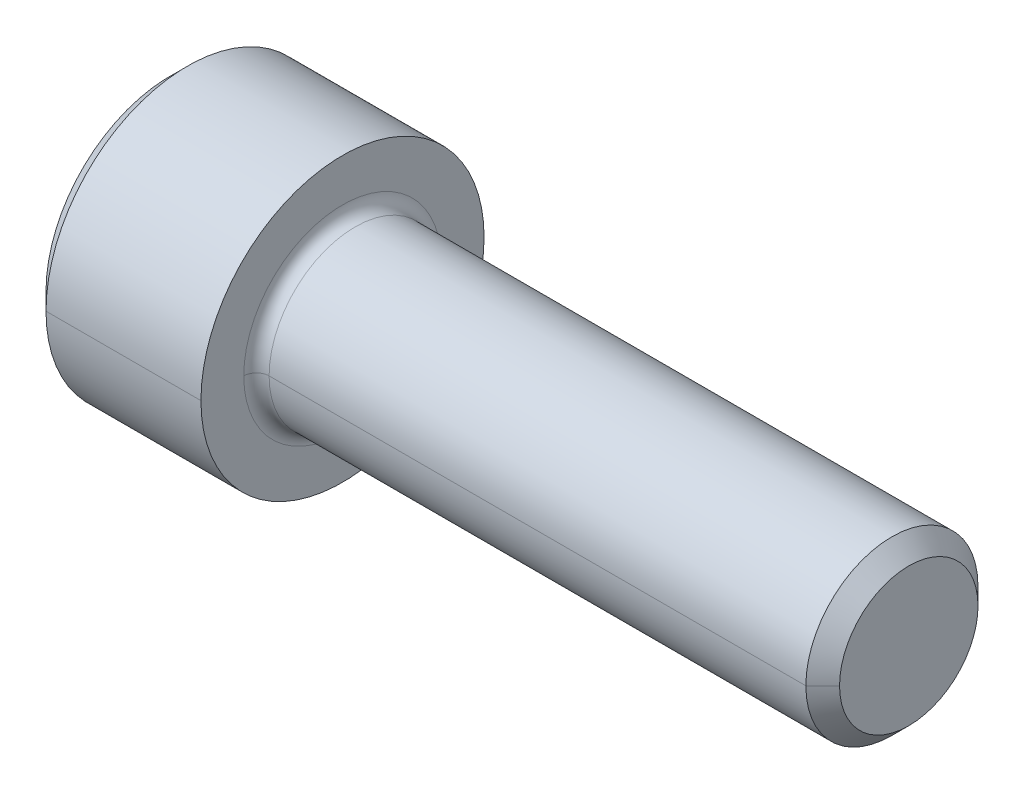
ISO-10303-21;
HEADER;
FILE_DESCRIPTION(('STEP AP214'),'2;1');
FILE_NAME('part.step','',(''),(''),'','','');
FILE_SCHEMA(('AUTOMOTIVE_DESIGN { 1 0 10303 214 1 1 1 1 }'));
ENDSEC;
DATA;
#1=APPLICATION_CONTEXT('core data for automotive mechanical design processes');
#2=APPLICATION_PROTOCOL_DEFINITION('international standard','automotive_design',2000,#1);
#3=PRODUCT_CONTEXT('',#1,'mechanical');
#4=PRODUCT('Part','Part','',(#3));
#5=PRODUCT_RELATED_PRODUCT_CATEGORY('part','',(#4));
#6=PRODUCT_DEFINITION_FORMATION('','',#4);
#7=PRODUCT_DEFINITION_CONTEXT('part definition',#1,'design');
#8=PRODUCT_DEFINITION('design','',#6,#7);
#9=PRODUCT_DEFINITION_SHAPE('','',#8);
#10=(LENGTH_UNIT() NAMED_UNIT(*) SI_UNIT(.MILLI.,.METRE.));
#11=(NAMED_UNIT(*) PLANE_ANGLE_UNIT() SI_UNIT($,.RADIAN.));
#12=(NAMED_UNIT(*) SI_UNIT($,.STERADIAN.) SOLID_ANGLE_UNIT());
#13=UNCERTAINTY_MEASURE_WITH_UNIT(LENGTH_MEASURE(1.E-05),#10,'distance_accuracy_value','');
#14=(GEOMETRIC_REPRESENTATION_CONTEXT(3) GLOBAL_UNCERTAINTY_ASSIGNED_CONTEXT((#13)) GLOBAL_UNIT_ASSIGNED_CONTEXT((#10,
#11,#12)) REPRESENTATION_CONTEXT('',''));
#15=CARTESIAN_POINT('',(0.,0.,0.));
#16=DIRECTION('',(0.,0.,1.));
#17=DIRECTION('',(1.,0.,0.));
#18=AXIS2_PLACEMENT_3D('',#15,#16,#17);
#19=CARTESIAN_POINT('',(2.286,0.,0.));
#20=DIRECTION('',(-1.,0.,0.));
#21=DIRECTION('',(0.,0.,1.));
#22=AXIS2_PLACEMENT_3D('',#19,#20,#21);
#23=CONICAL_SURFACE('',#22,1.98501,1.0471975511966);
#24=DIRECTION('',(-0.5,0.,-0.866025403784437));
#25=VECTOR('',#24,1.);
#26=CARTESIAN_POINT('',(2.286,0.,-1.98501));
#27=LINE('',#26,#25);
#28=CARTESIAN_POINT('',(3.43204605784411,0.,0.));
#29=VERTEX_POINT('',#28);
#30=CARTESIAN_POINT('',(2.286,0.,-1.98501));
#31=VERTEX_POINT('',#30);
#32=EDGE_CURVE('E174',#29,#31,#27,.T.);
#33=ORIENTED_EDGE('',*,*,#32,.F.);
#34=DIRECTION('',(-0.5,0.,0.866025403784437));
#35=VECTOR('',#34,1.);
#36=CARTESIAN_POINT('',(2.286,0.,1.98501));
#37=LINE('',#36,#35);
#38=CARTESIAN_POINT('',(2.286,0.,1.98501));
#39=VERTEX_POINT('',#38);
#40=EDGE_CURVE('E176',#29,#39,#37,.T.);
#41=ORIENTED_EDGE('',*,*,#40,.T.);
#42=CARTESIAN_POINT('',(2.286,0.,0.));
#43=DIRECTION('',(-1.,0.,0.));
#44=DIRECTION('',(0.,0.,1.));
#45=AXIS2_PLACEMENT_3D('',#42,#43,#44);
#46=CIRCLE('',#45,1.98501);
#47=CARTESIAN_POINT('',(2.286,1.71906908676615,0.992505));
#48=VERTEX_POINT('',#47);
#49=EDGE_CURVE('E11',#39,#48,#46,.T.);
#50=ORIENTED_EDGE('',*,*,#49,.T.);
#51=CARTESIAN_POINT('',(2.286,0.,0.));
#52=DIRECTION('',(-1.,0.,0.));
#53=DIRECTION('',(0.,0.,1.));
#54=AXIS2_PLACEMENT_3D('',#51,#52,#53);
#55=CIRCLE('',#54,1.98501);
#56=CARTESIAN_POINT('',(2.286,1.71906908676615,-0.992505));
#57=VERTEX_POINT('',#56);
#58=EDGE_CURVE('E20',#48,#57,#55,.T.);
#59=ORIENTED_EDGE('',*,*,#58,.T.);
#60=CARTESIAN_POINT('',(2.286,0.,0.));
#61=DIRECTION('',(-1.,0.,0.));
#62=DIRECTION('',(0.,0.,1.));
#63=AXIS2_PLACEMENT_3D('',#60,#61,#62);
#64=CIRCLE('',#63,1.98501);
#65=EDGE_CURVE('E177',#57,#31,#64,.T.);
#66=ORIENTED_EDGE('',*,*,#65,.T.);
#67=EDGE_LOOP('',(#33,#41,#50,#59,#66));
#68=FACE_BOUND('',#67,.T.);
#69=ADVANCED_FACE('F17',(#68),#23,.F.);
#70=CARTESIAN_POINT('',(2.286,1.14604605784411,1.98501));
#71=DIRECTION('',(-1.,0.,0.));
#72=DIRECTION('',(0.,0.,1.));
#73=AXIS2_PLACEMENT_3D('',#70,#71,#72);
#74=PLANE('',#73);
#75=ORIENTED_EDGE('',*,*,#49,.F.);
#76=DIRECTION('',(0.,1.,0.));
#77=VECTOR('',#76,1.);
#78=CARTESIAN_POINT('',(2.286,-1.14604605784409,1.98501));
#79=LINE('',#78,#77);
#80=CARTESIAN_POINT('',(2.286,1.14604605784411,1.98501));
#81=VERTEX_POINT('',#80);
#82=EDGE_CURVE('E206',#39,#81,#79,.T.);
#83=ORIENTED_EDGE('',*,*,#82,.T.);
#84=DIRECTION('',(0.,-0.5,0.86602540378444));
#85=VECTOR('',#84,1.);
#86=CARTESIAN_POINT('',(2.286,2.29209211568821,0.));
#87=LINE('',#86,#85);
#88=EDGE_CURVE('E207',#48,#81,#87,.T.);
#89=ORIENTED_EDGE('',*,*,#88,.F.);
#90=EDGE_LOOP('',(#75,#83,#89));
#91=FACE_BOUND('',#90,.T.);
#92=ADVANCED_FACE('F781',(#91),#74,.T.);
#93=CARTESIAN_POINT('',(2.286,1.14604605784411,1.98501));
#94=DIRECTION('',(-1.,0.,0.));
#95=DIRECTION('',(0.,0.,1.));
#96=AXIS2_PLACEMENT_3D('',#93,#94,#95);
#97=PLANE('',#96);
#98=ORIENTED_EDGE('',*,*,#58,.F.);
#99=DIRECTION('',(0.,-0.5,0.86602540378444));
#100=VECTOR('',#99,1.);
#101=CARTESIAN_POINT('',(2.286,2.29209211568821,0.));
#102=LINE('',#101,#100);
#103=CARTESIAN_POINT('',(2.286,2.29209211568821,0.));
#104=VERTEX_POINT('',#103);
#105=EDGE_CURVE('E233',#104,#48,#102,.T.);
#106=ORIENTED_EDGE('',*,*,#105,.F.);
#107=DIRECTION('',(0.,-0.5,-0.866025403784438));
#108=VECTOR('',#107,1.);
#109=CARTESIAN_POINT('',(2.286,2.29209211568821,0.));
#110=LINE('',#109,#108);
#111=EDGE_CURVE('E296',#104,#57,#110,.T.);
#112=ORIENTED_EDGE('',*,*,#111,.T.);
#113=EDGE_LOOP('',(#98,#106,#112));
#114=FACE_BOUND('',#113,.T.);
#115=ADVANCED_FACE('F679',(#114),#97,.T.);
#116=CARTESIAN_POINT('',(2.286,1.14604605784411,1.98501));
#117=DIRECTION('',(-1.,0.,0.));
#118=DIRECTION('',(0.,0.,1.));
#119=AXIS2_PLACEMENT_3D('',#116,#117,#118);
#120=PLANE('',#119);
#121=ORIENTED_EDGE('',*,*,#65,.F.);
#122=DIRECTION('',(0.,-0.5,-0.866025403784438));
#123=VECTOR('',#122,1.);
#124=CARTESIAN_POINT('',(2.286,2.29209211568821,0.));
#125=LINE('',#124,#123);
#126=CARTESIAN_POINT('',(2.286,1.1460460578441,-1.98501));
#127=VERTEX_POINT('',#126);
#128=EDGE_CURVE('E47',#57,#127,#125,.T.);
#129=ORIENTED_EDGE('',*,*,#128,.T.);
#130=DIRECTION('',(0.,-1.,0.));
#131=VECTOR('',#130,1.);
#132=CARTESIAN_POINT('',(2.286,1.1460460578441,-1.98501));
#133=LINE('',#132,#131);
#134=EDGE_CURVE('E352',#127,#31,#133,.T.);
#135=ORIENTED_EDGE('',*,*,#134,.T.);
#136=EDGE_LOOP('',(#121,#129,#135));
#137=FACE_BOUND('',#136,.T.);
#138=ADVANCED_FACE('F674',(#137),#120,.T.);
#139=CARTESIAN_POINT('',(2.286,1.14604605784411,1.98501));
#140=DIRECTION('',(-1.,0.,0.));
#141=DIRECTION('',(0.,0.,1.));
#142=AXIS2_PLACEMENT_3D('',#139,#140,#141);
#143=PLANE('',#142);
#144=CARTESIAN_POINT('',(2.286,0.,0.));
#145=DIRECTION('',(-1.,0.,0.));
#146=DIRECTION('',(0.,0.,1.));
#147=AXIS2_PLACEMENT_3D('',#144,#145,#146);
#148=CIRCLE('',#147,1.98501);
#149=CARTESIAN_POINT('',(2.286,-1.71906908676615,-0.992505));
#150=VERTEX_POINT('',#149);
#151=EDGE_CURVE('E181',#31,#150,#148,.T.);
#152=ORIENTED_EDGE('',*,*,#151,.F.);
#153=DIRECTION('',(0.,-1.,0.));
#154=VECTOR('',#153,1.);
#155=CARTESIAN_POINT('',(2.286,1.1460460578441,-1.98501));
#156=LINE('',#155,#154);
#157=CARTESIAN_POINT('',(2.286,-1.1460460578441,-1.98501));
#158=VERTEX_POINT('',#157);
#159=EDGE_CURVE('E213',#31,#158,#156,.T.);
#160=ORIENTED_EDGE('',*,*,#159,.T.);
#161=DIRECTION('',(0.,0.5,-0.86602540378444));
#162=VECTOR('',#161,1.);
#163=CARTESIAN_POINT('',(2.286,-2.2920921156882,0.));
#164=LINE('',#163,#162);
#165=EDGE_CURVE('E214',#150,#158,#164,.T.);
#166=ORIENTED_EDGE('',*,*,#165,.F.);
#167=EDGE_LOOP('',(#152,#160,#166));
#168=FACE_BOUND('',#167,.T.);
#169=ADVANCED_FACE('F678',(#168),#143,.T.);
#170=CARTESIAN_POINT('',(2.286,1.14604605784411,1.98501));
#171=DIRECTION('',(-1.,0.,0.));
#172=DIRECTION('',(0.,0.,1.));
#173=AXIS2_PLACEMENT_3D('',#170,#171,#172);
#174=PLANE('',#173);
#175=CARTESIAN_POINT('',(2.286,0.,0.));
#176=DIRECTION('',(-1.,0.,0.));
#177=DIRECTION('',(0.,0.,1.));
#178=AXIS2_PLACEMENT_3D('',#175,#176,#177);
#179=CIRCLE('',#178,1.98501);
#180=CARTESIAN_POINT('',(2.286,-1.71906908676614,0.992505));
#181=VERTEX_POINT('',#180);
#182=EDGE_CURVE('E202',#150,#181,#179,.T.);
#183=ORIENTED_EDGE('',*,*,#182,.F.);
#184=DIRECTION('',(0.,0.5,-0.86602540378444));
#185=VECTOR('',#184,1.);
#186=CARTESIAN_POINT('',(2.286,-2.2920921156882,0.));
#187=LINE('',#186,#185);
#188=CARTESIAN_POINT('',(2.286,-2.2920921156882,0.));
#189=VERTEX_POINT('',#188);
#190=EDGE_CURVE('E269',#189,#150,#187,.T.);
#191=ORIENTED_EDGE('',*,*,#190,.F.);
#192=DIRECTION('',(0.,-0.5,-0.866025403784438));
#193=VECTOR('',#192,1.);
#194=CARTESIAN_POINT('',(2.286,-1.14604605784409,1.98501));
#195=LINE('',#194,#193);
#196=EDGE_CURVE('E351',#181,#189,#195,.T.);
#197=ORIENTED_EDGE('',*,*,#196,.F.);
#198=EDGE_LOOP('',(#183,#191,#197));
#199=FACE_BOUND('',#198,.T.);
#200=ADVANCED_FACE('F865',(#199),#174,.T.);
#201=CARTESIAN_POINT('',(2.286,1.14604605784411,1.98501));
#202=DIRECTION('',(-1.,0.,0.));
#203=DIRECTION('',(0.,0.,1.));
#204=AXIS2_PLACEMENT_3D('',#201,#202,#203);
#205=PLANE('',#204);
#206=CARTESIAN_POINT('',(2.286,0.,0.));
#207=DIRECTION('',(-1.,0.,0.));
#208=DIRECTION('',(0.,0.,1.));
#209=AXIS2_PLACEMENT_3D('',#206,#207,#208);
#210=CIRCLE('',#209,1.98501);
#211=EDGE_CURVE('E187',#181,#39,#210,.T.);
#212=ORIENTED_EDGE('',*,*,#211,.F.);
#213=DIRECTION('',(0.,-0.5,-0.866025403784438));
#214=VECTOR('',#213,1.);
#215=CARTESIAN_POINT('',(2.286,-1.14604605784409,1.98501));
#216=LINE('',#215,#214);
#217=CARTESIAN_POINT('',(2.286,-1.14604605784409,1.98501));
#218=VERTEX_POINT('',#217);
#219=EDGE_CURVE('E347',#218,#181,#216,.T.);
#220=ORIENTED_EDGE('',*,*,#219,.F.);
#221=DIRECTION('',(0.,1.,0.));
#222=VECTOR('',#221,1.);
#223=CARTESIAN_POINT('',(2.286,-1.14604605784409,1.98501));
#224=LINE('',#223,#222);
#225=EDGE_CURVE('E336',#218,#39,#224,.T.);
#226=ORIENTED_EDGE('',*,*,#225,.T.);
#227=EDGE_LOOP('',(#212,#220,#226));
#228=FACE_BOUND('',#227,.T.);
#229=ADVANCED_FACE('F856',(#228),#205,.T.);
#230=CARTESIAN_POINT('',(2.286,2.29209211568821,0.));
#231=DIRECTION('',(0.,0.866025403784438,-0.5));
#232=DIRECTION('',(-1.,0.,0.));
#233=AXIS2_PLACEMENT_3D('',#230,#231,#232);
#234=PLANE('',#233);
#235=DIRECTION('',(0.,-0.5,-0.866025403784438));
#236=VECTOR('',#235,1.);
#237=CARTESIAN_POINT('',(0.,2.29209211568821,0.));
#238=LINE('',#237,#236);
#239=CARTESIAN_POINT('',(0.,2.29209211568821,0.));
#240=VERTEX_POINT('',#239);
#241=CARTESIAN_POINT('',(0.,1.1460460578441,-1.98501));
#242=VERTEX_POINT('',#241);
#243=EDGE_CURVE('E314',#240,#242,#238,.T.);
#244=ORIENTED_EDGE('',*,*,#243,.T.);
#245=DIRECTION('',(-1.,0.,0.));
#246=VECTOR('',#245,1.);
#247=CARTESIAN_POINT('',(2.286,1.1460460578441,-1.98501));
#248=LINE('',#247,#246);
#249=EDGE_CURVE('E355',#127,#242,#248,.T.);
#250=ORIENTED_EDGE('',*,*,#249,.F.);
#251=ORIENTED_EDGE('',*,*,#128,.F.);
#252=ORIENTED_EDGE('',*,*,#111,.F.);
#253=DIRECTION('',(-1.,0.,0.));
#254=VECTOR('',#253,1.);
#255=CARTESIAN_POINT('',(2.286,2.29209211568821,0.));
#256=LINE('',#255,#254);
#257=EDGE_CURVE('E237',#104,#240,#256,.T.);
#258=ORIENTED_EDGE('',*,*,#257,.T.);
#259=EDGE_LOOP('',(#244,#250,#251,#252,#258));
#260=FACE_BOUND('',#259,.T.);
#261=ADVANCED_FACE('F847',(#260),#234,.F.);
#262=CARTESIAN_POINT('',(2.286,1.1460460578441,-1.98501));
#263=DIRECTION('',(0.,0.,-1.));
#264=DIRECTION('',(0.,-1.,0.));
#265=AXIS2_PLACEMENT_3D('',#262,#263,#264);
#266=PLANE('',#265);
#267=DIRECTION('',(0.,-1.,0.));
#268=VECTOR('',#267,1.);
#269=CARTESIAN_POINT('',(0.,1.1460460578441,-1.98501));
#270=LINE('',#269,#268);
#271=CARTESIAN_POINT('',(0.,-1.1460460578441,-1.98501));
#272=VERTEX_POINT('',#271);
#273=EDGE_CURVE('E310',#242,#272,#270,.T.);
#274=ORIENTED_EDGE('',*,*,#273,.T.);
#275=DIRECTION('',(-1.,0.,0.));
#276=VECTOR('',#275,1.);
#277=CARTESIAN_POINT('',(2.286,-1.1460460578441,-1.98501));
#278=LINE('',#277,#276);
#279=EDGE_CURVE('E210',#158,#272,#278,.T.);
#280=ORIENTED_EDGE('',*,*,#279,.F.);
#281=ORIENTED_EDGE('',*,*,#159,.F.);
#282=ORIENTED_EDGE('',*,*,#134,.F.);
#283=ORIENTED_EDGE('',*,*,#249,.T.);
#284=EDGE_LOOP('',(#274,#280,#281,#282,#283));
#285=FACE_BOUND('',#284,.T.);
#286=ADVANCED_FACE('F838',(#285),#266,.F.);
#287=CARTESIAN_POINT('',(2.286,-2.2920921156882,0.));
#288=DIRECTION('',(0.,0.866025403784439,0.5));
#289=DIRECTION('',(1.,0.,0.));
#290=AXIS2_PLACEMENT_3D('',#287,#288,#289);
#291=PLANE('',#290);
#292=DIRECTION('',(0.,0.5,-0.86602540378444));
#293=VECTOR('',#292,1.);
#294=CARTESIAN_POINT('',(0.,-2.2920921156882,0.));
#295=LINE('',#294,#293);
#296=CARTESIAN_POINT('',(0.,-2.2920921156882,0.));
#297=VERTEX_POINT('',#296);
#298=EDGE_CURVE('E306',#297,#272,#295,.T.);
#299=ORIENTED_EDGE('',*,*,#298,.F.);
#300=DIRECTION('',(-1.,0.,0.));
#301=VECTOR('',#300,1.);
#302=CARTESIAN_POINT('',(2.286,-2.2920921156882,0.));
#303=LINE('',#302,#301);
#304=EDGE_CURVE('E359',#189,#297,#303,.T.);
#305=ORIENTED_EDGE('',*,*,#304,.F.);
#306=ORIENTED_EDGE('',*,*,#190,.T.);
#307=ORIENTED_EDGE('',*,*,#165,.T.);
#308=ORIENTED_EDGE('',*,*,#279,.T.);
#309=EDGE_LOOP('',(#299,#305,#306,#307,#308));
#310=FACE_BOUND('',#309,.T.);
#311=ADVANCED_FACE('F829',(#310),#291,.T.);
#312=CARTESIAN_POINT('',(2.286,-1.14604605784409,1.98501));
#313=DIRECTION('',(0.,0.866025403784438,-0.5));
#314=DIRECTION('',(-1.,0.,0.));
#315=AXIS2_PLACEMENT_3D('',#312,#313,#314);
#316=PLANE('',#315);
#317=DIRECTION('',(0.,-0.5,-0.866025403784438));
#318=VECTOR('',#317,1.);
#319=CARTESIAN_POINT('',(0.,-1.14604605784409,1.98501));
#320=LINE('',#319,#318);
#321=CARTESIAN_POINT('',(0.,-1.14604605784409,1.98501));
#322=VERTEX_POINT('',#321);
#323=EDGE_CURVE('E219',#322,#297,#320,.T.);
#324=ORIENTED_EDGE('',*,*,#323,.F.);
#325=DIRECTION('',(-1.,0.,0.));
#326=VECTOR('',#325,1.);
#327=CARTESIAN_POINT('',(2.286,-1.14604605784409,1.98501));
#328=LINE('',#327,#326);
#329=EDGE_CURVE('E344',#218,#322,#328,.T.);
#330=ORIENTED_EDGE('',*,*,#329,.F.);
#331=ORIENTED_EDGE('',*,*,#219,.T.);
#332=ORIENTED_EDGE('',*,*,#196,.T.);
#333=ORIENTED_EDGE('',*,*,#304,.T.);
#334=EDGE_LOOP('',(#324,#330,#331,#332,#333));
#335=FACE_BOUND('',#334,.T.);
#336=ADVANCED_FACE('F720',(#335),#316,.T.);
#337=CARTESIAN_POINT('',(2.286,-1.14604605784409,1.98501));
#338=DIRECTION('',(0.,0.,1.));
#339=DIRECTION('',(0.,-1.,0.));
#340=AXIS2_PLACEMENT_3D('',#337,#338,#339);
#341=PLANE('',#340);
#342=DIRECTION('',(0.,1.,0.));
#343=VECTOR('',#342,1.);
#344=CARTESIAN_POINT('',(0.,-1.14604605784409,1.98501));
#345=LINE('',#344,#343);
#346=CARTESIAN_POINT('',(0.,1.14604605784411,1.98501));
#347=VERTEX_POINT('',#346);
#348=EDGE_CURVE('E215',#322,#347,#345,.T.);
#349=ORIENTED_EDGE('',*,*,#348,.T.);
#350=DIRECTION('',(-1.,0.,0.));
#351=VECTOR('',#350,1.);
#352=CARTESIAN_POINT('',(2.286,1.14604605784411,1.98501));
#353=LINE('',#352,#351);
#354=EDGE_CURVE('E203',#81,#347,#353,.T.);
#355=ORIENTED_EDGE('',*,*,#354,.F.);
#356=ORIENTED_EDGE('',*,*,#82,.F.);
#357=ORIENTED_EDGE('',*,*,#225,.F.);
#358=ORIENTED_EDGE('',*,*,#329,.T.);
#359=EDGE_LOOP('',(#349,#355,#356,#357,#358));
#360=FACE_BOUND('',#359,.T.);
#361=ADVANCED_FACE('F715',(#360),#341,.F.);
#362=CARTESIAN_POINT('',(2.286,2.29209211568821,0.));
#363=DIRECTION('',(0.,-0.86602540378444,-0.5));
#364=DIRECTION('',(0.,0.5,-0.86602540378444));
#365=AXIS2_PLACEMENT_3D('',#362,#363,#364);
#366=PLANE('',#365);
#367=DIRECTION('',(0.,-0.5,0.86602540378444));
#368=VECTOR('',#367,1.);
#369=CARTESIAN_POINT('',(0.,2.29209211568821,0.));
#370=LINE('',#369,#368);
#371=EDGE_CURVE('E220',#240,#347,#370,.T.);
#372=ORIENTED_EDGE('',*,*,#371,.F.);
#373=ORIENTED_EDGE('',*,*,#257,.F.);
#374=ORIENTED_EDGE('',*,*,#105,.T.);
#375=ORIENTED_EDGE('',*,*,#88,.T.);
#376=ORIENTED_EDGE('',*,*,#354,.T.);
#377=EDGE_LOOP('',(#372,#373,#374,#375,#376));
#378=FACE_BOUND('',#377,.T.);
#379=ADVANCED_FACE('F719',(#378),#366,.T.);
#380=CARTESIAN_POINT('',(5.1816,0.,0.));
#381=DIRECTION('',(1.,0.,0.));
#382=DIRECTION('',(0.,0.,-1.));
#383=AXIS2_PLACEMENT_3D('',#380,#381,#382);
#384=TOROIDAL_SURFACE('',#383,2.7686,0.3556);
#385=CARTESIAN_POINT('',(5.1816,0.,2.7686));
#386=DIRECTION('',(0.,1.,0.));
#387=DIRECTION('',(0.,0.,1.));
#388=AXIS2_PLACEMENT_3D('',#385,#386,#387);
#389=CIRCLE('',#388,0.3556);
#390=CARTESIAN_POINT('',(5.1816,0.,2.413));
#391=VERTEX_POINT('',#390);
#392=CARTESIAN_POINT('',(4.826,0.,2.7686));
#393=VERTEX_POINT('',#392);
#394=EDGE_CURVE('E199',#391,#393,#389,.T.);
#395=ORIENTED_EDGE('',*,*,#394,.F.);
#396=CARTESIAN_POINT('',(5.1816,0.,0.));
#397=DIRECTION('',(1.,0.,0.));
#398=DIRECTION('',(0.,0.,-1.));
#399=AXIS2_PLACEMENT_3D('',#396,#397,#398);
#400=CIRCLE('',#399,2.413);
#401=CARTESIAN_POINT('',(5.1816,0.,-2.413));
#402=VERTEX_POINT('',#401);
#403=EDGE_CURVE('E262',#402,#391,#400,.T.);
#404=ORIENTED_EDGE('',*,*,#403,.F.);
#405=CARTESIAN_POINT('',(5.1816,0.,-2.7686));
#406=DIRECTION('',(0.,-1.,0.));
#407=DIRECTION('',(0.,0.,-1.));
#408=AXIS2_PLACEMENT_3D('',#405,#406,#407);
#409=CIRCLE('',#408,0.3556);
#410=CARTESIAN_POINT('',(4.826,0.,-2.7686));
#411=VERTEX_POINT('',#410);
#412=EDGE_CURVE('E241',#402,#411,#409,.T.);
#413=ORIENTED_EDGE('',*,*,#412,.T.);
#414=CARTESIAN_POINT('',(4.826,0.,0.));
#415=DIRECTION('',(-1.,0.,0.));
#416=DIRECTION('',(0.,0.,-1.));
#417=AXIS2_PLACEMENT_3D('',#414,#415,#416);
#418=CIRCLE('',#417,2.7686);
#419=EDGE_CURVE('E324',#393,#411,#418,.T.);
#420=ORIENTED_EDGE('',*,*,#419,.F.);
#421=EDGE_LOOP('',(#395,#404,#413,#420));
#422=FACE_BOUND('',#421,.T.);
#423=ADVANCED_FACE('F742',(#422),#384,.F.);
#424=CARTESIAN_POINT('',(20.701,1.94056,0.));
#425=DIRECTION('',(1.,0.,0.));
#426=DIRECTION('',(0.,1.,0.));
#427=AXIS2_PLACEMENT_3D('',#424,#425,#426);
#428=PLANE('',#427);
#429=CARTESIAN_POINT('',(20.701,0.,0.));
#430=DIRECTION('',(-1.,0.,0.));
#431=DIRECTION('',(0.,0.,1.));
#432=AXIS2_PLACEMENT_3D('',#429,#430,#431);
#433=CIRCLE('',#432,1.94056);
#434=CARTESIAN_POINT('',(20.701,0.,1.94056));
#435=VERTEX_POINT('',#434);
#436=CARTESIAN_POINT('',(20.701,0.,-1.94056));
#437=VERTEX_POINT('',#436);
#438=EDGE_CURVE('E247',#435,#437,#433,.T.);
#439=ORIENTED_EDGE('',*,*,#438,.F.);
#440=CARTESIAN_POINT('',(20.701,0.,0.));
#441=DIRECTION('',(-1.,0.,0.));
#442=DIRECTION('',(0.,0.,1.));
#443=AXIS2_PLACEMENT_3D('',#440,#441,#442);
#444=CIRCLE('',#443,1.94056);
#445=EDGE_CURVE('E333',#437,#435,#444,.T.);
#446=ORIENTED_EDGE('',*,*,#445,.F.);
#447=EDGE_LOOP('',(#439,#446));
#448=FACE_BOUND('',#447,.T.);
#449=ADVANCED_FACE('F689',(#448),#428,.T.);
#450=CARTESIAN_POINT('',(20.701,0.,0.));
#451=DIRECTION('',(-1.,0.,0.));
#452=DIRECTION('',(0.,0.,1.));
#453=AXIS2_PLACEMENT_3D('',#450,#451,#452);
#454=CONICAL_SURFACE('',#453,1.94056,0.785398163397408);
#455=DIRECTION('',(-0.707106781186576,0.,-0.707106781186519));
#456=VECTOR('',#455,1.);
#457=CARTESIAN_POINT('',(20.701,0.,-1.94056));
#458=LINE('',#457,#456);
#459=CARTESIAN_POINT('',(20.22856,0.,-2.41299999999997));
#460=VERTEX_POINT('',#459);
#461=EDGE_CURVE('E242',#437,#460,#458,.T.);
#462=ORIENTED_EDGE('',*,*,#461,.F.);
#463=ORIENTED_EDGE('',*,*,#445,.T.);
#464=DIRECTION('',(-0.707106781186576,0.,0.707106781186519));
#465=VECTOR('',#464,1.);
#466=CARTESIAN_POINT('',(20.701,0.,1.94056));
#467=LINE('',#466,#465);
#468=CARTESIAN_POINT('',(20.22856,0.,2.41299999999997));
#469=VERTEX_POINT('',#468);
#470=EDGE_CURVE('E254',#435,#469,#467,.T.);
#471=ORIENTED_EDGE('',*,*,#470,.T.);
#472=CARTESIAN_POINT('',(20.22856,0.,0.));
#473=DIRECTION('',(-1.,0.,0.));
#474=DIRECTION('',(0.,0.,1.));
#475=AXIS2_PLACEMENT_3D('',#472,#473,#474);
#476=CIRCLE('',#475,2.41299999999997);
#477=EDGE_CURVE('E330',#460,#469,#476,.T.);
#478=ORIENTED_EDGE('',*,*,#477,.F.);
#479=EDGE_LOOP('',(#462,#463,#471,#478));
#480=FACE_BOUND('',#479,.T.);
#481=ADVANCED_FACE('F684',(#480),#454,.T.);
#482=CARTESIAN_POINT('',(-31.75,0.,0.));
#483=DIRECTION('',(-1.,0.,0.));
#484=DIRECTION('',(0.,0.,1.));
#485=AXIS2_PLACEMENT_3D('',#482,#483,#484);
#486=CYLINDRICAL_SURFACE('',#485,2.413);
#487=DIRECTION('',(-1.,0.,0.));
#488=VECTOR('',#487,1.);
#489=CARTESIAN_POINT('',(-31.75,0.,-2.413));
#490=LINE('',#489,#488);
#491=EDGE_CURVE('E258',#460,#402,#490,.T.);
#492=ORIENTED_EDGE('',*,*,#491,.F.);
#493=ORIENTED_EDGE('',*,*,#477,.T.);
#494=DIRECTION('',(-1.,0.,0.));
#495=VECTOR('',#494,1.);
#496=CARTESIAN_POINT('',(-31.75,0.,2.413));
#497=LINE('',#496,#495);
#498=EDGE_CURVE('E228',#469,#391,#497,.T.);
#499=ORIENTED_EDGE('',*,*,#498,.T.);
#500=CARTESIAN_POINT('',(5.1816,0.,0.));
#501=DIRECTION('',(1.,0.,0.));
#502=DIRECTION('',(0.,0.,-1.));
#503=AXIS2_PLACEMENT_3D('',#500,#501,#502);
#504=CIRCLE('',#503,2.413);
#505=EDGE_CURVE('E195',#391,#402,#504,.T.);
#506=ORIENTED_EDGE('',*,*,#505,.T.);
#507=EDGE_LOOP('',(#492,#493,#499,#506));
#508=FACE_BOUND('',#507,.T.);
#509=ADVANCED_FACE('F688',(#508),#486,.T.);
#510=CARTESIAN_POINT('',(4.826,3.96875,0.));
#511=DIRECTION('',(1.,0.,0.));
#512=DIRECTION('',(0.,1.,0.));
#513=AXIS2_PLACEMENT_3D('',#510,#511,#512);
#514=PLANE('',#513);
#515=CARTESIAN_POINT('',(4.826,0.,0.));
#516=DIRECTION('',(-1.,0.,0.));
#517=DIRECTION('',(0.,0.,-1.));
#518=AXIS2_PLACEMENT_3D('',#515,#516,#517);
#519=CIRCLE('',#518,2.7686);
#520=EDGE_CURVE('E232',#411,#393,#519,.T.);
#521=ORIENTED_EDGE('',*,*,#520,.T.);
#522=ORIENTED_EDGE('',*,*,#419,.T.);
#523=EDGE_LOOP('',(#521,#522));
#524=FACE_BOUND('',#523,.T.);
#525=CARTESIAN_POINT('',(4.826,0.,0.));
#526=DIRECTION('',(-1.,0.,0.));
#527=DIRECTION('',(0.,0.,1.));
#528=AXIS2_PLACEMENT_3D('',#525,#526,#527);
#529=CIRCLE('',#528,3.96875);
#530=CARTESIAN_POINT('',(4.826,0.,3.96875));
#531=VERTEX_POINT('',#530);
#532=CARTESIAN_POINT('',(4.826,0.,-3.96875));
#533=VERTEX_POINT('',#532);
#534=EDGE_CURVE('E223',#531,#533,#529,.T.);
#535=ORIENTED_EDGE('',*,*,#534,.F.);
#536=CARTESIAN_POINT('',(4.826,0.,0.));
#537=DIRECTION('',(-1.,0.,0.));
#538=DIRECTION('',(0.,0.,1.));
#539=AXIS2_PLACEMENT_3D('',#536,#537,#538);
#540=CIRCLE('',#539,3.96875);
#541=EDGE_CURVE('E321',#533,#531,#540,.T.);
#542=ORIENTED_EDGE('',*,*,#541,.F.);
#543=EDGE_LOOP('',(#535,#542));
#544=FACE_BOUND('',#543,.T.);
#545=ADVANCED_FACE('F802',(#524,#544),#514,.T.);
#546=CARTESIAN_POINT('',(-31.75,0.,0.));
#547=DIRECTION('',(-1.,0.,0.));
#548=DIRECTION('',(0.,0.,1.));
#549=AXIS2_PLACEMENT_3D('',#546,#547,#548);
#550=CYLINDRICAL_SURFACE('',#549,3.96875);
#551=DIRECTION('',(-1.,0.,0.));
#552=VECTOR('',#551,1.);
#553=CARTESIAN_POINT('',(-31.75,0.,-3.96875));
#554=LINE('',#553,#552);
#555=CARTESIAN_POINT('',(0.4826,0.,-3.96875));
#556=VERTEX_POINT('',#555);
#557=EDGE_CURVE('E227',#533,#556,#554,.T.);
#558=ORIENTED_EDGE('',*,*,#557,.F.);
#559=ORIENTED_EDGE('',*,*,#541,.T.);
#560=DIRECTION('',(-1.,0.,0.));
#561=VECTOR('',#560,1.);
#562=CARTESIAN_POINT('',(-31.75,0.,3.96875));
#563=LINE('',#562,#561);
#564=CARTESIAN_POINT('',(0.4826,0.,3.96875));
#565=VERTEX_POINT('',#564);
#566=EDGE_CURVE('E277',#531,#565,#563,.T.);
#567=ORIENTED_EDGE('',*,*,#566,.T.);
#568=CARTESIAN_POINT('',(0.4826,0.,0.));
#569=DIRECTION('',(-1.,0.,0.));
#570=DIRECTION('',(0.,0.,1.));
#571=AXIS2_PLACEMENT_3D('',#568,#569,#570);
#572=CIRCLE('',#571,3.96875);
#573=EDGE_CURVE('E317',#556,#565,#572,.T.);
#574=ORIENTED_EDGE('',*,*,#573,.F.);
#575=EDGE_LOOP('',(#558,#559,#567,#574));
#576=FACE_BOUND('',#575,.T.);
#577=ADVANCED_FACE('F793',(#576),#550,.T.);
#578=CARTESIAN_POINT('',(0.,0.,0.));
#579=DIRECTION('',(1.,0.,0.));
#580=DIRECTION('',(0.,0.,-1.));
#581=AXIS2_PLACEMENT_3D('',#578,#579,#580);
#582=CONICAL_SURFACE('',#581,3.48615,0.78539816339745);
#583=DIRECTION('',(0.707106781186546,0.,0.707106781186549));
#584=VECTOR('',#583,1.);
#585=CARTESIAN_POINT('',(0.,0.,3.48615));
#586=LINE('',#585,#584);
#587=CARTESIAN_POINT('',(0.,0.,3.48615));
#588=VERTEX_POINT('',#587);
#589=EDGE_CURVE('E285',#588,#565,#586,.T.);
#590=ORIENTED_EDGE('',*,*,#589,.F.);
#591=CARTESIAN_POINT('',(0.,0.,0.));
#592=DIRECTION('',(-1.,0.,0.));
#593=DIRECTION('',(0.,0.,1.));
#594=AXIS2_PLACEMENT_3D('',#591,#592,#593);
#595=CIRCLE('',#594,3.48615);
#596=CARTESIAN_POINT('',(0.,0.,-3.48615));
#597=VERTEX_POINT('',#596);
#598=EDGE_CURVE('E293',#597,#588,#595,.T.);
#599=ORIENTED_EDGE('',*,*,#598,.F.);
#600=DIRECTION('',(0.707106781186546,0.,-0.707106781186549));
#601=VECTOR('',#600,1.);
#602=CARTESIAN_POINT('',(0.,0.,-3.48615));
#603=LINE('',#602,#601);
#604=EDGE_CURVE('E289',#597,#556,#603,.T.);
#605=ORIENTED_EDGE('',*,*,#604,.T.);
#606=ORIENTED_EDGE('',*,*,#573,.T.);
#607=EDGE_LOOP('',(#590,#599,#605,#606));
#608=FACE_BOUND('',#607,.T.);
#609=ADVANCED_FACE('F767',(#608),#582,.T.);
#610=CARTESIAN_POINT('',(0.,0.,0.));
#611=DIRECTION('',(-1.,0.,0.));
#612=DIRECTION('',(0.,0.,1.));
#613=AXIS2_PLACEMENT_3D('',#610,#611,#612);
#614=PLANE('',#613);
#615=ORIENTED_EDGE('',*,*,#371,.T.);
#616=ORIENTED_EDGE('',*,*,#348,.F.);
#617=ORIENTED_EDGE('',*,*,#323,.T.);
#618=ORIENTED_EDGE('',*,*,#298,.T.);
#619=ORIENTED_EDGE('',*,*,#273,.F.);
#620=ORIENTED_EDGE('',*,*,#243,.F.);
#621=EDGE_LOOP('',(#615,#616,#617,#618,#619,#620));
#622=FACE_BOUND('',#621,.T.);
#623=ORIENTED_EDGE('',*,*,#598,.T.);
#624=CARTESIAN_POINT('',(0.,0.,0.));
#625=DIRECTION('',(-1.,0.,0.));
#626=DIRECTION('',(0.,0.,1.));
#627=AXIS2_PLACEMENT_3D('',#624,#625,#626);
#628=CIRCLE('',#627,3.48615);
#629=EDGE_CURVE('E281',#588,#597,#628,.T.);
#630=ORIENTED_EDGE('',*,*,#629,.T.);
#631=EDGE_LOOP('',(#623,#630));
#632=FACE_BOUND('',#631,.T.);
#633=ADVANCED_FACE('F700',(#622,#632),#614,.T.);
#634=CARTESIAN_POINT('',(0.,0.,0.));
#635=DIRECTION('',(1.,0.,0.));
#636=DIRECTION('',(0.,0.,-1.));
#637=AXIS2_PLACEMENT_3D('',#634,#635,#636);
#638=CONICAL_SURFACE('',#637,3.48615,0.78539816339745);
#639=ORIENTED_EDGE('',*,*,#629,.F.);
#640=ORIENTED_EDGE('',*,*,#589,.T.);
#641=CARTESIAN_POINT('',(0.4826,0.,0.));
#642=DIRECTION('',(-1.,0.,0.));
#643=DIRECTION('',(0.,0.,1.));
#644=AXIS2_PLACEMENT_3D('',#641,#642,#643);
#645=CIRCLE('',#644,3.96875);
#646=EDGE_CURVE('E273',#565,#556,#645,.T.);
#647=ORIENTED_EDGE('',*,*,#646,.T.);
#648=ORIENTED_EDGE('',*,*,#604,.F.);
#649=EDGE_LOOP('',(#639,#640,#647,#648));
#650=FACE_BOUND('',#649,.T.);
#651=ADVANCED_FACE('F695',(#650),#638,.T.);
#652=CARTESIAN_POINT('',(-31.75,0.,0.));
#653=DIRECTION('',(-1.,0.,0.));
#654=DIRECTION('',(0.,0.,1.));
#655=AXIS2_PLACEMENT_3D('',#652,#653,#654);
#656=CYLINDRICAL_SURFACE('',#655,3.96875);
#657=ORIENTED_EDGE('',*,*,#534,.T.);
#658=ORIENTED_EDGE('',*,*,#557,.T.);
#659=ORIENTED_EDGE('',*,*,#646,.F.);
#660=ORIENTED_EDGE('',*,*,#566,.F.);
#661=EDGE_LOOP('',(#657,#658,#659,#660));
#662=FACE_BOUND('',#661,.T.);
#663=ADVANCED_FACE('F699',(#662),#656,.T.);
#664=CARTESIAN_POINT('',(-31.75,0.,0.));
#665=DIRECTION('',(-1.,0.,0.));
#666=DIRECTION('',(0.,0.,1.));
#667=AXIS2_PLACEMENT_3D('',#664,#665,#666);
#668=CYLINDRICAL_SURFACE('',#667,2.413);
#669=CARTESIAN_POINT('',(20.22856,0.,0.));
#670=DIRECTION('',(-1.,0.,0.));
#671=DIRECTION('',(0.,0.,1.));
#672=AXIS2_PLACEMENT_3D('',#669,#670,#671);
#673=CIRCLE('',#672,2.41299999999997);
#674=EDGE_CURVE('E246',#469,#460,#673,.T.);
#675=ORIENTED_EDGE('',*,*,#674,.T.);
#676=ORIENTED_EDGE('',*,*,#491,.T.);
#677=ORIENTED_EDGE('',*,*,#403,.T.);
#678=ORIENTED_EDGE('',*,*,#498,.F.);
#679=EDGE_LOOP('',(#675,#676,#677,#678));
#680=FACE_BOUND('',#679,.T.);
#681=ADVANCED_FACE('F709',(#680),#668,.T.);
#682=CARTESIAN_POINT('',(20.701,0.,0.));
#683=DIRECTION('',(-1.,0.,0.));
#684=DIRECTION('',(0.,0.,1.));
#685=AXIS2_PLACEMENT_3D('',#682,#683,#684);
#686=CONICAL_SURFACE('',#685,1.94056,0.785398163397408);
#687=ORIENTED_EDGE('',*,*,#438,.T.);
#688=ORIENTED_EDGE('',*,*,#461,.T.);
#689=ORIENTED_EDGE('',*,*,#674,.F.);
#690=ORIENTED_EDGE('',*,*,#470,.F.);
#691=EDGE_LOOP('',(#687,#688,#689,#690));
#692=FACE_BOUND('',#691,.T.);
#693=ADVANCED_FACE('F668',(#692),#686,.T.);
#694=CARTESIAN_POINT('',(5.1816,0.,0.));
#695=DIRECTION('',(1.,0.,0.));
#696=DIRECTION('',(0.,0.,-1.));
#697=AXIS2_PLACEMENT_3D('',#694,#695,#696);
#698=TOROIDAL_SURFACE('',#697,2.7686,0.3556);
#699=ORIENTED_EDGE('',*,*,#505,.F.);
#700=ORIENTED_EDGE('',*,*,#394,.T.);
#701=ORIENTED_EDGE('',*,*,#520,.F.);
#702=ORIENTED_EDGE('',*,*,#412,.F.);
#703=EDGE_LOOP('',(#699,#700,#701,#702));
#704=FACE_BOUND('',#703,.T.);
#705=ADVANCED_FACE('F660',(#704),#698,.F.);
#706=CARTESIAN_POINT('',(2.286,0.,0.));
#707=DIRECTION('',(-1.,0.,0.));
#708=DIRECTION('',(0.,0.,1.));
#709=AXIS2_PLACEMENT_3D('',#706,#707,#708);
#710=CONICAL_SURFACE('',#709,1.98501,1.0471975511966);
#711=ORIENTED_EDGE('',*,*,#40,.F.);
#712=ORIENTED_EDGE('',*,*,#32,.T.);
#713=ORIENTED_EDGE('',*,*,#151,.T.);
#714=ORIENTED_EDGE('',*,*,#182,.T.);
#715=ORIENTED_EDGE('',*,*,#211,.T.);
#716=EDGE_LOOP('',(#711,#712,#713,#714,#715));
#717=FACE_BOUND('',#716,.T.);
#718=ADVANCED_FACE('F184',(#717),#710,.F.);
#719=CLOSED_SHELL('',(#69,#92,#115,#138,#169,#200,#229,#261,#286,#311,#336,#361,#379,#423,#449,
#481,#509,#545,#577,#609,#633,#651,#663,#681,#693,#705,#718));
#720=MANIFOLD_SOLID_BREP('B1',#719);
#721=ADVANCED_BREP_SHAPE_REPRESENTATION('',(#18,#720),#14);
#722=SHAPE_DEFINITION_REPRESENTATION(#9,#721);
ENDSEC;
END-ISO-10303-21;
